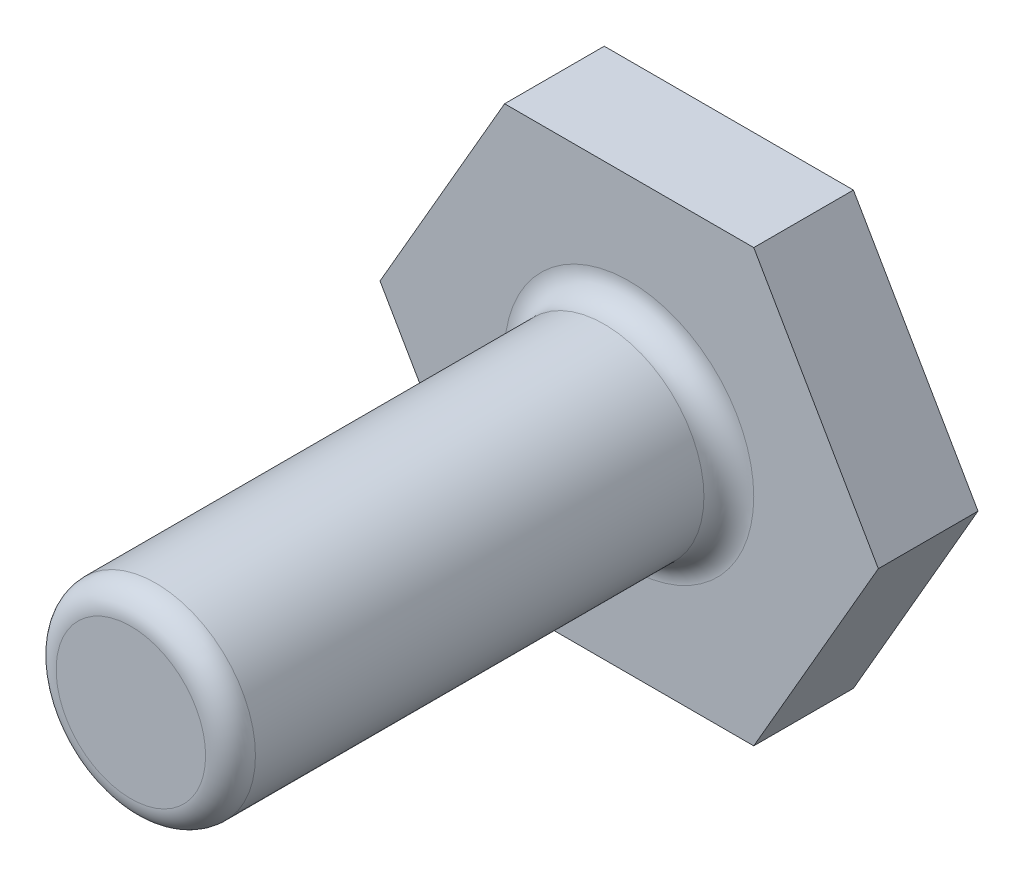
ISO-10303-21;
HEADER;
FILE_DESCRIPTION(('STEP AP214'),'2;1');
FILE_NAME('part.step','',(''),(''),'','','');
FILE_SCHEMA(('AUTOMOTIVE_DESIGN { 1 0 10303 214 1 1 1 1 }'));
ENDSEC;
DATA;
#1=APPLICATION_CONTEXT('core data for automotive mechanical design processes');
#2=APPLICATION_PROTOCOL_DEFINITION('international standard','automotive_design',2000,#1);
#3=PRODUCT_CONTEXT('',#1,'mechanical');
#4=PRODUCT('Part','Part','',(#3));
#5=PRODUCT_RELATED_PRODUCT_CATEGORY('part','',(#4));
#6=PRODUCT_DEFINITION_FORMATION('','',#4);
#7=PRODUCT_DEFINITION_CONTEXT('part definition',#1,'design');
#8=PRODUCT_DEFINITION('design','',#6,#7);
#9=PRODUCT_DEFINITION_SHAPE('','',#8);
#10=(LENGTH_UNIT() NAMED_UNIT(*) SI_UNIT(.MILLI.,.METRE.));
#11=(NAMED_UNIT(*) PLANE_ANGLE_UNIT() SI_UNIT($,.RADIAN.));
#12=(NAMED_UNIT(*) SI_UNIT($,.STERADIAN.) SOLID_ANGLE_UNIT());
#13=UNCERTAINTY_MEASURE_WITH_UNIT(LENGTH_MEASURE(1.E-05),#10,'distance_accuracy_value','');
#14=(GEOMETRIC_REPRESENTATION_CONTEXT(3) GLOBAL_UNCERTAINTY_ASSIGNED_CONTEXT((#13)) GLOBAL_UNIT_ASSIGNED_CONTEXT((#10,
#11,#12)) REPRESENTATION_CONTEXT('',''));
#15=CARTESIAN_POINT('',(0.,0.,0.));
#16=DIRECTION('',(0.,0.,1.));
#17=DIRECTION('',(1.,0.,0.));
#18=AXIS2_PLACEMENT_3D('',#15,#16,#17);
#19=CARTESIAN_POINT('',(0.,0.,4.));
#20=DIRECTION('',(0.,0.,1.));
#21=DIRECTION('',(1.,0.,0.));
#22=AXIS2_PLACEMENT_3D('',#19,#20,#21);
#23=PLANE('',#22);
#24=CARTESIAN_POINT('',(0.,0.,4.));
#25=DIRECTION('',(0.,0.,1.));
#26=DIRECTION('',(1.,0.,0.));
#27=AXIS2_PLACEMENT_3D('',#24,#25,#26);
#28=CIRCLE('',#27,5.);
#29=CARTESIAN_POINT('',(5.,0.,4.));
#30=VERTEX_POINT('',#29);
#31=EDGE_CURVE('E11',#30,#30,#28,.F.);
#32=ORIENTED_EDGE('',*,*,#31,.T.);
#33=EDGE_LOOP('',(#32));
#34=FACE_BOUND('',#33,.T.);
#35=DIRECTION('',(-0.5,-0.866025403784439,0.));
#36=VECTOR('',#35,1.);
#37=CARTESIAN_POINT('',(-5.,8.66025403784439,4.));
#38=LINE('',#37,#36);
#39=CARTESIAN_POINT('',(-5.,8.66025403784439,4.));
#40=VERTEX_POINT('',#39);
#41=CARTESIAN_POINT('',(-10.,0.,4.));
#42=VERTEX_POINT('',#41);
#43=EDGE_CURVE('E130',#40,#42,#38,.T.);
#44=ORIENTED_EDGE('',*,*,#43,.T.);
#45=DIRECTION('',(0.5,-0.866025403784438,0.));
#46=VECTOR('',#45,1.);
#47=CARTESIAN_POINT('',(-10.,0.,4.));
#48=LINE('',#47,#46);
#49=CARTESIAN_POINT('',(-5.,-8.66025403784438,4.));
#50=VERTEX_POINT('',#49);
#51=EDGE_CURVE('E90',#42,#50,#48,.T.);
#52=ORIENTED_EDGE('',*,*,#51,.T.);
#53=DIRECTION('',(1.,0.,0.));
#54=VECTOR('',#53,1.);
#55=CARTESIAN_POINT('',(-5.,-8.66025403784438,4.));
#56=LINE('',#55,#54);
#57=CARTESIAN_POINT('',(5.,-8.66025403784438,4.));
#58=VERTEX_POINT('',#57);
#59=EDGE_CURVE('E102',#50,#58,#56,.T.);
#60=ORIENTED_EDGE('',*,*,#59,.T.);
#61=DIRECTION('',(0.5,0.866025403784439,0.));
#62=VECTOR('',#61,1.);
#63=CARTESIAN_POINT('',(5.,-8.66025403784438,4.));
#64=LINE('',#63,#62);
#65=CARTESIAN_POINT('',(10.,0.,4.));
#66=VERTEX_POINT('',#65);
#67=EDGE_CURVE('E97',#58,#66,#64,.T.);
#68=ORIENTED_EDGE('',*,*,#67,.T.);
#69=DIRECTION('',(-0.5,0.866025403784439,0.));
#70=VECTOR('',#69,1.);
#71=CARTESIAN_POINT('',(10.,0.,4.));
#72=LINE('',#71,#70);
#73=CARTESIAN_POINT('',(5.,8.66025403784439,4.));
#74=VERTEX_POINT('',#73);
#75=EDGE_CURVE('E100',#66,#74,#72,.T.);
#76=ORIENTED_EDGE('',*,*,#75,.T.);
#77=DIRECTION('',(-1.,0.,0.));
#78=VECTOR('',#77,1.);
#79=CARTESIAN_POINT('',(5.,8.66025403784439,4.));
#80=LINE('',#79,#78);
#81=EDGE_CURVE('E52',#74,#40,#80,.T.);
#82=ORIENTED_EDGE('',*,*,#81,.T.);
#83=EDGE_LOOP('',(#44,#52,#60,#68,#76,#82));
#84=FACE_BOUND('',#83,.T.);
#85=ADVANCED_FACE('F35',(#34,#84),#23,.T.);
#86=CARTESIAN_POINT('',(-5.,8.66025403784439,4.));
#87=DIRECTION('',(0.866025403784439,-0.5,0.));
#88=DIRECTION('',(0.5,0.866025403784439,0.));
#89=AXIS2_PLACEMENT_3D('',#86,#87,#88);
#90=PLANE('',#89);
#91=DIRECTION('',(-0.5,-0.866025403784439,0.));
#92=VECTOR('',#91,1.);
#93=CARTESIAN_POINT('',(-5.,8.66025403784439,0.));
#94=LINE('',#93,#92);
#95=CARTESIAN_POINT('',(-5.,8.66025403784439,0.));
#96=VERTEX_POINT('',#95);
#97=CARTESIAN_POINT('',(-10.,0.,0.));
#98=VERTEX_POINT('',#97);
#99=EDGE_CURVE('E120',#96,#98,#94,.T.);
#100=ORIENTED_EDGE('',*,*,#99,.T.);
#101=DIRECTION('',(0.,0.,-1.));
#102=VECTOR('',#101,1.);
#103=CARTESIAN_POINT('',(-10.,0.,4.));
#104=LINE('',#103,#102);
#105=EDGE_CURVE('E137',#42,#98,#104,.T.);
#106=ORIENTED_EDGE('',*,*,#105,.F.);
#107=ORIENTED_EDGE('',*,*,#43,.F.);
#108=DIRECTION('',(0.,0.,-1.));
#109=VECTOR('',#108,1.);
#110=CARTESIAN_POINT('',(-5.,8.66025403784439,4.));
#111=LINE('',#110,#109);
#112=EDGE_CURVE('E116',#40,#96,#111,.T.);
#113=ORIENTED_EDGE('',*,*,#112,.T.);
#114=EDGE_LOOP('',(#100,#106,#107,#113));
#115=FACE_BOUND('',#114,.T.);
#116=ADVANCED_FACE('F164',(#115),#90,.F.);
#117=CARTESIAN_POINT('',(-10.,0.,4.));
#118=DIRECTION('',(0.866025403784438,0.5,0.));
#119=DIRECTION('',(-0.5,0.866025403784438,0.));
#120=AXIS2_PLACEMENT_3D('',#117,#118,#119);
#121=PLANE('',#120);
#122=DIRECTION('',(0.5,-0.866025403784438,0.));
#123=VECTOR('',#122,1.);
#124=CARTESIAN_POINT('',(-10.,0.,0.));
#125=LINE('',#124,#123);
#126=CARTESIAN_POINT('',(-5.,-8.66025403784438,0.));
#127=VERTEX_POINT('',#126);
#128=EDGE_CURVE('E123',#98,#127,#125,.T.);
#129=ORIENTED_EDGE('',*,*,#128,.T.);
#130=DIRECTION('',(0.,0.,-1.));
#131=VECTOR('',#130,1.);
#132=CARTESIAN_POINT('',(-5.,-8.66025403784438,4.));
#133=LINE('',#132,#131);
#134=EDGE_CURVE('E134',#50,#127,#133,.T.);
#135=ORIENTED_EDGE('',*,*,#134,.F.);
#136=ORIENTED_EDGE('',*,*,#51,.F.);
#137=ORIENTED_EDGE('',*,*,#105,.T.);
#138=EDGE_LOOP('',(#129,#135,#136,#137));
#139=FACE_BOUND('',#138,.T.);
#140=ADVANCED_FACE('F170',(#139),#121,.F.);
#141=CARTESIAN_POINT('',(-5.,-8.66025403784438,4.));
#142=DIRECTION('',(0.,1.,0.));
#143=DIRECTION('',(-1.,0.,0.));
#144=AXIS2_PLACEMENT_3D('',#141,#142,#143);
#145=PLANE('',#144);
#146=DIRECTION('',(1.,0.,0.));
#147=VECTOR('',#146,1.);
#148=CARTESIAN_POINT('',(-5.,-8.66025403784438,0.));
#149=LINE('',#148,#147);
#150=CARTESIAN_POINT('',(5.,-8.66025403784438,0.));
#151=VERTEX_POINT('',#150);
#152=EDGE_CURVE('E125',#127,#151,#149,.T.);
#153=ORIENTED_EDGE('',*,*,#152,.T.);
#154=DIRECTION('',(0.,0.,-1.));
#155=VECTOR('',#154,1.);
#156=CARTESIAN_POINT('',(5.,-8.66025403784438,4.));
#157=LINE('',#156,#155);
#158=EDGE_CURVE('E111',#58,#151,#157,.T.);
#159=ORIENTED_EDGE('',*,*,#158,.F.);
#160=ORIENTED_EDGE('',*,*,#59,.F.);
#161=ORIENTED_EDGE('',*,*,#134,.T.);
#162=EDGE_LOOP('',(#153,#159,#160,#161));
#163=FACE_BOUND('',#162,.T.);
#164=ADVANCED_FACE('F184',(#163),#145,.F.);
#165=CARTESIAN_POINT('',(5.,-8.66025403784438,4.));
#166=DIRECTION('',(-0.866025403784439,0.5,0.));
#167=DIRECTION('',(-0.5,-0.866025403784439,0.));
#168=AXIS2_PLACEMENT_3D('',#165,#166,#167);
#169=PLANE('',#168);
#170=DIRECTION('',(0.5,0.866025403784439,0.));
#171=VECTOR('',#170,1.);
#172=CARTESIAN_POINT('',(5.,-8.66025403784438,0.));
#173=LINE('',#172,#171);
#174=CARTESIAN_POINT('',(10.,0.,0.));
#175=VERTEX_POINT('',#174);
#176=EDGE_CURVE('E110',#151,#175,#173,.T.);
#177=ORIENTED_EDGE('',*,*,#176,.T.);
#178=DIRECTION('',(0.,0.,-1.));
#179=VECTOR('',#178,1.);
#180=CARTESIAN_POINT('',(10.,0.,4.));
#181=LINE('',#180,#179);
#182=EDGE_CURVE('E107',#66,#175,#181,.T.);
#183=ORIENTED_EDGE('',*,*,#182,.F.);
#184=ORIENTED_EDGE('',*,*,#67,.F.);
#185=ORIENTED_EDGE('',*,*,#158,.T.);
#186=EDGE_LOOP('',(#177,#183,#184,#185));
#187=FACE_BOUND('',#186,.T.);
#188=ADVANCED_FACE('F108',(#187),#169,.F.);
#189=CARTESIAN_POINT('',(10.,0.,4.));
#190=DIRECTION('',(-0.866025403784439,-0.5,0.));
#191=DIRECTION('',(0.5,-0.866025403784439,0.));
#192=AXIS2_PLACEMENT_3D('',#189,#190,#191);
#193=PLANE('',#192);
#194=DIRECTION('',(-0.5,0.866025403784439,0.));
#195=VECTOR('',#194,1.);
#196=CARTESIAN_POINT('',(10.,0.,0.));
#197=LINE('',#196,#195);
#198=CARTESIAN_POINT('',(5.,8.66025403784439,0.));
#199=VERTEX_POINT('',#198);
#200=EDGE_CURVE('E75',#175,#199,#197,.T.);
#201=ORIENTED_EDGE('',*,*,#200,.T.);
#202=DIRECTION('',(0.,0.,-1.));
#203=VECTOR('',#202,1.);
#204=CARTESIAN_POINT('',(5.,8.66025403784439,4.));
#205=LINE('',#204,#203);
#206=EDGE_CURVE('E112',#74,#199,#205,.T.);
#207=ORIENTED_EDGE('',*,*,#206,.F.);
#208=ORIENTED_EDGE('',*,*,#75,.F.);
#209=ORIENTED_EDGE('',*,*,#182,.T.);
#210=EDGE_LOOP('',(#201,#207,#208,#209));
#211=FACE_BOUND('',#210,.T.);
#212=ADVANCED_FACE('F114',(#211),#193,.F.);
#213=CARTESIAN_POINT('',(5.,8.66025403784439,4.));
#214=DIRECTION('',(0.,-1.,0.));
#215=DIRECTION('',(0.,0.,-1.));
#216=AXIS2_PLACEMENT_3D('',#213,#214,#215);
#217=PLANE('',#216);
#218=DIRECTION('',(-1.,0.,0.));
#219=VECTOR('',#218,1.);
#220=CARTESIAN_POINT('',(5.,8.66025403784439,0.));
#221=LINE('',#220,#219);
#222=EDGE_CURVE('E81',#199,#96,#221,.T.);
#223=ORIENTED_EDGE('',*,*,#222,.T.);
#224=ORIENTED_EDGE('',*,*,#112,.F.);
#225=ORIENTED_EDGE('',*,*,#81,.F.);
#226=ORIENTED_EDGE('',*,*,#206,.T.);
#227=EDGE_LOOP('',(#223,#224,#225,#226));
#228=FACE_BOUND('',#227,.T.);
#229=ADVANCED_FACE('F176',(#228),#217,.F.);
#230=CARTESIAN_POINT('',(0.,0.,0.));
#231=DIRECTION('',(0.,0.,1.));
#232=DIRECTION('',(1.,0.,0.));
#233=AXIS2_PLACEMENT_3D('',#230,#231,#232);
#234=PLANE('',#233);
#235=ORIENTED_EDGE('',*,*,#99,.F.);
#236=ORIENTED_EDGE('',*,*,#222,.F.);
#237=ORIENTED_EDGE('',*,*,#200,.F.);
#238=ORIENTED_EDGE('',*,*,#176,.F.);
#239=ORIENTED_EDGE('',*,*,#152,.F.);
#240=ORIENTED_EDGE('',*,*,#128,.F.);
#241=EDGE_LOOP('',(#235,#236,#237,#238,#239,#240));
#242=FACE_BOUND('',#241,.T.);
#243=ADVANCED_FACE('F161',(#242),#234,.F.);
#244=CARTESIAN_POINT('',(0.,0.,24.));
#245=DIRECTION('',(0.,0.,-1.));
#246=DIRECTION('',(-1.,0.,0.));
#247=AXIS2_PLACEMENT_3D('',#244,#245,#246);
#248=CYLINDRICAL_SURFACE('',#247,4.);
#249=CARTESIAN_POINT('',(0.,0.,23.));
#250=DIRECTION('',(0.,0.,1.));
#251=DIRECTION('',(1.,0.,0.));
#252=AXIS2_PLACEMENT_3D('',#249,#250,#251);
#253=CIRCLE('',#252,4.);
#254=CARTESIAN_POINT('',(4.,0.,23.));
#255=VERTEX_POINT('',#254);
#256=EDGE_CURVE('E44',#255,#255,#253,.F.);
#257=ORIENTED_EDGE('',*,*,#256,.T.);
#258=EDGE_LOOP('',(#257));
#259=FACE_BOUND('',#258,.T.);
#260=CARTESIAN_POINT('',(0.,0.,5.));
#261=DIRECTION('',(0.,0.,1.));
#262=DIRECTION('',(1.,0.,0.));
#263=AXIS2_PLACEMENT_3D('',#260,#261,#262);
#264=CIRCLE('',#263,4.);
#265=CARTESIAN_POINT('',(4.,0.,5.));
#266=VERTEX_POINT('',#265);
#267=EDGE_CURVE('E142',#266,#266,#264,.T.);
#268=ORIENTED_EDGE('',*,*,#267,.T.);
#269=EDGE_LOOP('',(#268));
#270=FACE_BOUND('',#269,.T.);
#271=ADVANCED_FACE('F147',(#259,#270),#248,.T.);
#272=CARTESIAN_POINT('',(0.,0.,24.));
#273=DIRECTION('',(0.,0.,1.));
#274=DIRECTION('',(1.,0.,0.));
#275=AXIS2_PLACEMENT_3D('',#272,#273,#274);
#276=PLANE('',#275);
#277=CARTESIAN_POINT('',(0.,0.,24.));
#278=DIRECTION('',(0.,0.,1.));
#279=DIRECTION('',(1.,0.,0.));
#280=AXIS2_PLACEMENT_3D('',#277,#278,#279);
#281=CIRCLE('',#280,3.);
#282=CARTESIAN_POINT('',(3.,0.,24.));
#283=VERTEX_POINT('',#282);
#284=EDGE_CURVE('E139',#283,#283,#281,.T.);
#285=ORIENTED_EDGE('',*,*,#284,.T.);
#286=EDGE_LOOP('',(#285));
#287=FACE_BOUND('',#286,.T.);
#288=ADVANCED_FACE('F153',(#287),#276,.T.);
#289=CARTESIAN_POINT('',(0.,0.,23.));
#290=DIRECTION('',(0.,0.,1.));
#291=DIRECTION('',(1.,0.,0.));
#292=AXIS2_PLACEMENT_3D('',#289,#290,#291);
#293=TOROIDAL_SURFACE('',#292,3.,1.);
#294=ORIENTED_EDGE('',*,*,#256,.F.);
#295=EDGE_LOOP('',(#294));
#296=FACE_BOUND('',#295,.T.);
#297=ORIENTED_EDGE('',*,*,#284,.F.);
#298=EDGE_LOOP('',(#297));
#299=FACE_BOUND('',#298,.T.);
#300=ADVANCED_FACE('F150',(#296,#299),#293,.T.);
#301=CARTESIAN_POINT('',(0.,0.,5.));
#302=DIRECTION('',(0.,0.,1.));
#303=DIRECTION('',(1.,0.,0.));
#304=AXIS2_PLACEMENT_3D('',#301,#302,#303);
#305=TOROIDAL_SURFACE('',#304,5.,1.);
#306=ORIENTED_EDGE('',*,*,#31,.F.);
#307=EDGE_LOOP('',(#306));
#308=FACE_BOUND('',#307,.T.);
#309=ORIENTED_EDGE('',*,*,#267,.F.);
#310=EDGE_LOOP('',(#309));
#311=FACE_BOUND('',#310,.T.);
#312=ADVANCED_FACE('F37',(#308,#311),#305,.F.);
#313=CLOSED_SHELL('',(#85,#116,#140,#164,#188,#212,#229,#243,#271,#288,#300,#312));
#314=MANIFOLD_SOLID_BREP('B2',#313);
#315=ADVANCED_BREP_SHAPE_REPRESENTATION('',(#18,#314),#14);
#316=SHAPE_DEFINITION_REPRESENTATION(#9,#315);
ENDSEC;
END-ISO-10303-21;
